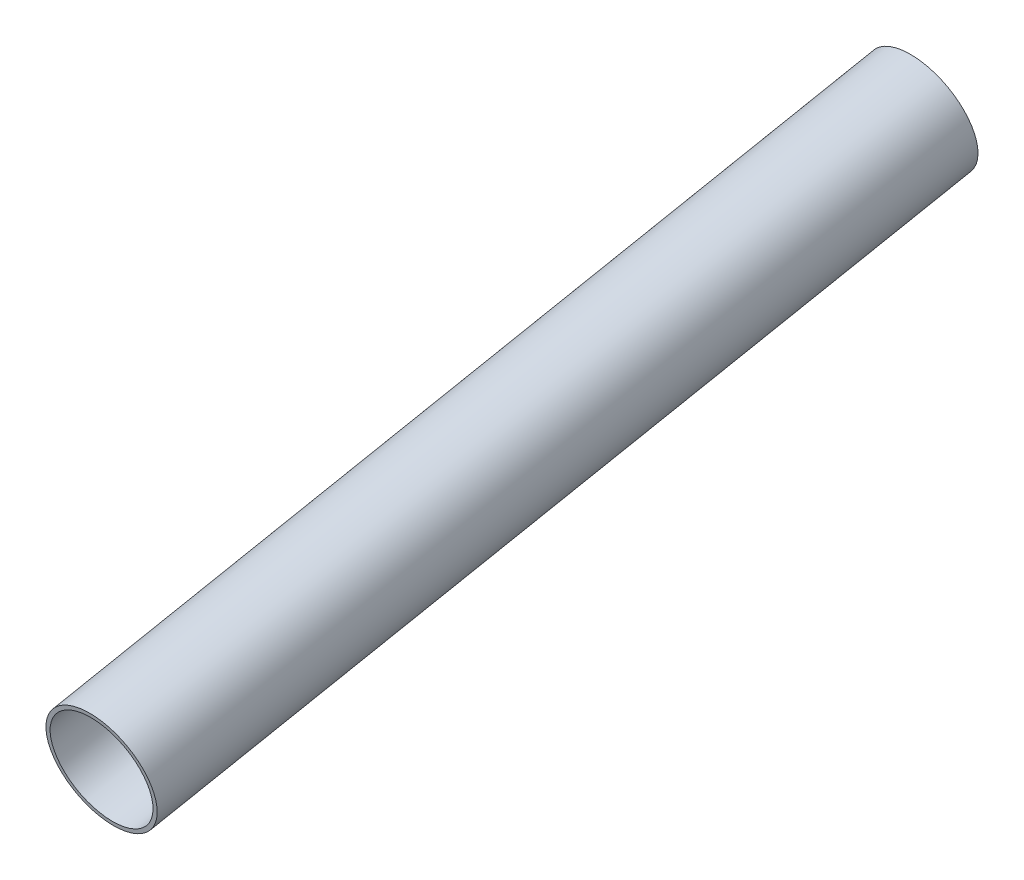
ISO-10303-21;
HEADER;
FILE_DESCRIPTION(('STEP AP214'),'2;1');
FILE_NAME('part.step','',(''),(''),'','','');
FILE_SCHEMA(('AUTOMOTIVE_DESIGN { 1 0 10303 214 1 1 1 1 }'));
ENDSEC;
DATA;
#1=APPLICATION_CONTEXT('core data for automotive mechanical design processes');
#2=APPLICATION_PROTOCOL_DEFINITION('international standard','automotive_design',2000,#1);
#3=PRODUCT_CONTEXT('',#1,'mechanical');
#4=PRODUCT('Part','Part','',(#3));
#5=PRODUCT_RELATED_PRODUCT_CATEGORY('part','',(#4));
#6=PRODUCT_DEFINITION_FORMATION('','',#4);
#7=PRODUCT_DEFINITION_CONTEXT('part definition',#1,'design');
#8=PRODUCT_DEFINITION('design','',#6,#7);
#9=PRODUCT_DEFINITION_SHAPE('','',#8);
#10=(LENGTH_UNIT() NAMED_UNIT(*) SI_UNIT(.MILLI.,.METRE.));
#11=(NAMED_UNIT(*) PLANE_ANGLE_UNIT() SI_UNIT($,.RADIAN.));
#12=(NAMED_UNIT(*) SI_UNIT($,.STERADIAN.) SOLID_ANGLE_UNIT());
#13=UNCERTAINTY_MEASURE_WITH_UNIT(LENGTH_MEASURE(1.E-05),#10,'distance_accuracy_value','');
#14=(GEOMETRIC_REPRESENTATION_CONTEXT(3) GLOBAL_UNCERTAINTY_ASSIGNED_CONTEXT((#13)) GLOBAL_UNIT_ASSIGNED_CONTEXT((#10,
#11,#12)) REPRESENTATION_CONTEXT('',''));
#15=CARTESIAN_POINT('',(0.,0.,0.));
#16=DIRECTION('',(0.,0.,1.));
#17=DIRECTION('',(1.,0.,0.));
#18=AXIS2_PLACEMENT_3D('',#15,#16,#17);
#19=CARTESIAN_POINT('',(-3.4942814640228,481.564752484477,1783.80729489507));
#20=DIRECTION('',(-0.00891620653526725,-0.201755507025084,0.979395332154525));
#21=DIRECTION('',(0.,-0.979434264822798,-0.201763527157475));
#22=AXIS2_PLACEMENT_3D('',#19,#20,#21);
#23=CYLINDRICAL_SURFACE('',#22,9.52499999999992);
#24=CARTESIAN_POINT('',(-3.4942814640228,481.564752484477,1783.80729489507));
#25=DIRECTION('',(-0.00891620653526725,-0.201755507025084,0.979395332154525));
#26=DIRECTION('',(0.,-0.979434264822798,-0.201763527157475));
#27=AXIS2_PLACEMENT_3D('',#24,#25,#26);
#28=CIRCLE('',#27,9.52499999999992);
#29=CARTESIAN_POINT('',(-3.4942814640228,472.23564111204,1781.88549729889));
#30=VERTEX_POINT('',#29);
#31=EDGE_CURVE('E10',#30,#30,#28,.T.);
#32=ORIENTED_EDGE('',*,*,#31,.T.);
#33=EDGE_LOOP('',(#32));
#34=FACE_BOUND('',#33,.T.);
#35=CARTESIAN_POINT('',(-4.77667716726507,452.546762121529,1924.67127788633));
#36=DIRECTION('',(-0.00891620653526725,-0.201755507025084,0.979395332154525));
#37=DIRECTION('',(0.,-0.979434264822798,-0.201763527157475));
#38=AXIS2_PLACEMENT_3D('',#35,#36,#37);
#39=CIRCLE('',#38,9.52499999999992);
#40=CARTESIAN_POINT('',(-4.77667716726507,443.217650749092,1922.74948029016));
#41=VERTEX_POINT('',#40);
#42=EDGE_CURVE('E41',#41,#41,#39,.T.);
#43=ORIENTED_EDGE('',*,*,#42,.F.);
#44=EDGE_LOOP('',(#43));
#45=FACE_BOUND('',#44,.T.);
#46=ADVANCED_FACE('F31',(#34,#45),#23,.T.);
#47=CARTESIAN_POINT('',(-3.4942814640228,481.564752484477,1783.80729489507));
#48=DIRECTION('',(-0.00891620653526725,-0.201755507025084,0.979395332154525));
#49=DIRECTION('',(0.,-0.979434264822798,-0.201763527157475));
#50=AXIS2_PLACEMENT_3D('',#47,#48,#49);
#51=PLANE('',#50);
#52=CARTESIAN_POINT('',(-3.4942814640228,481.564752484477,1783.80729489507));
#53=DIRECTION('',(-0.00891620653526725,-0.201755507025084,0.979395332154525));
#54=DIRECTION('',(0.,-0.979434264822798,-0.201763527157475));
#55=AXIS2_PLACEMENT_3D('',#52,#53,#54);
#56=CIRCLE('',#55,8.81379999999993);
#57=CARTESIAN_POINT('',(-3.4942814640228,472.932214761182,1782.02899151941));
#58=VERTEX_POINT('',#57);
#59=EDGE_CURVE('E37',#58,#58,#56,.T.);
#60=ORIENTED_EDGE('',*,*,#59,.T.);
#61=EDGE_LOOP('',(#60));
#62=FACE_BOUND('',#61,.T.);
#63=ORIENTED_EDGE('',*,*,#31,.F.);
#64=EDGE_LOOP('',(#63));
#65=FACE_BOUND('',#64,.T.);
#66=ADVANCED_FACE('F60',(#62,#65),#51,.F.);
#67=CARTESIAN_POINT('',(-3.4942814640228,481.564752484477,1783.80729489507));
#68=DIRECTION('',(-0.00891620653526725,-0.201755507025084,0.979395332154525));
#69=DIRECTION('',(0.,-0.979434264822798,-0.201763527157475));
#70=AXIS2_PLACEMENT_3D('',#67,#68,#69);
#71=CYLINDRICAL_SURFACE('',#70,8.81379999999993);
#72=ORIENTED_EDGE('',*,*,#59,.F.);
#73=EDGE_LOOP('',(#72));
#74=FACE_BOUND('',#73,.T.);
#75=CARTESIAN_POINT('',(-4.77667716726507,452.546762121529,1924.67127788633));
#76=DIRECTION('',(-0.00891620653526725,-0.201755507025084,0.979395332154525));
#77=DIRECTION('',(0.,-0.979434264822798,-0.201763527157475));
#78=AXIS2_PLACEMENT_3D('',#75,#76,#77);
#79=CIRCLE('',#78,8.81379999999993);
#80=CARTESIAN_POINT('',(-4.77667716726507,443.914224398234,1922.89297451067));
#81=VERTEX_POINT('',#80);
#82=EDGE_CURVE('E45',#81,#81,#79,.T.);
#83=ORIENTED_EDGE('',*,*,#82,.T.);
#84=EDGE_LOOP('',(#83));
#85=FACE_BOUND('',#84,.T.);
#86=ADVANCED_FACE('F51',(#74,#85),#71,.F.);
#87=CARTESIAN_POINT('',(-4.77667716726507,452.546762121529,1924.67127788633));
#88=DIRECTION('',(-0.00891620653526725,-0.201755507025084,0.979395332154525));
#89=DIRECTION('',(0.,-0.979434264822798,-0.201763527157475));
#90=AXIS2_PLACEMENT_3D('',#87,#88,#89);
#91=PLANE('',#90);
#92=ORIENTED_EDGE('',*,*,#42,.T.);
#93=EDGE_LOOP('',(#92));
#94=FACE_BOUND('',#93,.T.);
#95=ORIENTED_EDGE('',*,*,#82,.F.);
#96=EDGE_LOOP('',(#95));
#97=FACE_BOUND('',#96,.T.);
#98=ADVANCED_FACE('F53',(#94,#97),#91,.T.);
#99=CLOSED_SHELL('',(#46,#66,#86,#98));
#100=MANIFOLD_SOLID_BREP('B2',#99);
#101=ADVANCED_BREP_SHAPE_REPRESENTATION('',(#18,#100),#14);
#102=SHAPE_DEFINITION_REPRESENTATION(#9,#101);
ENDSEC;
END-ISO-10303-21;
